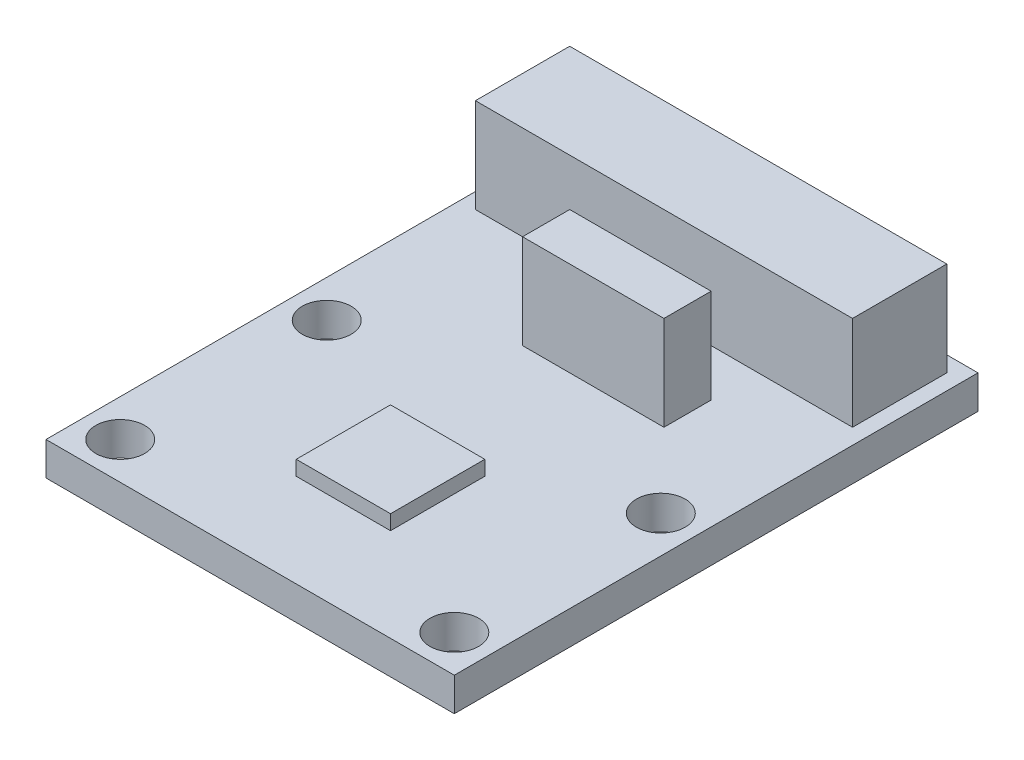
ISO-10303-21;
HEADER;
FILE_DESCRIPTION(('STEP AP214'),'2;1');
FILE_NAME('part.step','',(''),(''),'','','');
FILE_SCHEMA(('AUTOMOTIVE_DESIGN { 1 0 10303 214 1 1 1 1 }'));
ENDSEC;
DATA;
#1=APPLICATION_CONTEXT('core data for automotive mechanical design processes');
#2=APPLICATION_PROTOCOL_DEFINITION('international standard','automotive_design',2000,#1);
#3=PRODUCT_CONTEXT('',#1,'mechanical');
#4=PRODUCT('Part','Part','',(#3));
#5=PRODUCT_RELATED_PRODUCT_CATEGORY('part','',(#4));
#6=PRODUCT_DEFINITION_FORMATION('','',#4);
#7=PRODUCT_DEFINITION_CONTEXT('part definition',#1,'design');
#8=PRODUCT_DEFINITION('design','',#6,#7);
#9=PRODUCT_DEFINITION_SHAPE('','',#8);
#10=(LENGTH_UNIT() NAMED_UNIT(*) SI_UNIT(.MILLI.,.METRE.));
#11=(NAMED_UNIT(*) PLANE_ANGLE_UNIT() SI_UNIT($,.RADIAN.));
#12=(NAMED_UNIT(*) SI_UNIT($,.STERADIAN.) SOLID_ANGLE_UNIT());
#13=UNCERTAINTY_MEASURE_WITH_UNIT(LENGTH_MEASURE(1.E-05),#10,'distance_accuracy_value','');
#14=(GEOMETRIC_REPRESENTATION_CONTEXT(3) GLOBAL_UNCERTAINTY_ASSIGNED_CONTEXT((#13)) GLOBAL_UNIT_ASSIGNED_CONTEXT((#10,
#11,#12)) REPRESENTATION_CONTEXT('',''));
#15=CARTESIAN_POINT('',(0.,0.,0.));
#16=DIRECTION('',(0.,0.,1.));
#17=DIRECTION('',(1.,0.,0.));
#18=AXIS2_PLACEMENT_3D('',#15,#16,#17);
#19=CARTESIAN_POINT('',(0.,1.8,0.));
#20=DIRECTION('',(0.,-1.,0.));
#21=DIRECTION('',(0.,0.,-1.));
#22=AXIS2_PLACEMENT_3D('',#19,#20,#21);
#23=PLANE('',#22);
#24=DIRECTION('',(0.,0.,-1.));
#25=VECTOR('',#24,1.);
#26=CARTESIAN_POINT('',(-10.16,1.8,0.));
#27=LINE('',#26,#25);
#28=CARTESIAN_POINT('',(-10.16,1.8,-14.734192513565));
#29=VERTEX_POINT('',#28);
#30=CARTESIAN_POINT('',(-10.16,1.8,-19.814192513565));
#31=VERTEX_POINT('',#30);
#32=EDGE_CURVE('E173',#29,#31,#27,.T.);
#33=ORIENTED_EDGE('',*,*,#32,.T.);
#34=DIRECTION('',(1.,0.,0.));
#35=VECTOR('',#34,1.);
#36=CARTESIAN_POINT('',(0.,1.8,-19.814192513565));
#37=LINE('',#36,#35);
#38=CARTESIAN_POINT('',(10.16,1.8,-19.814192513565));
#39=VERTEX_POINT('',#38);
#40=EDGE_CURVE('E180',#31,#39,#37,.T.);
#41=ORIENTED_EDGE('',*,*,#40,.T.);
#42=DIRECTION('',(0.,0.,1.));
#43=VECTOR('',#42,1.);
#44=CARTESIAN_POINT('',(10.16,1.8,0.));
#45=LINE('',#44,#43);
#46=CARTESIAN_POINT('',(10.16,1.8,-14.734192513565));
#47=VERTEX_POINT('',#46);
#48=EDGE_CURVE('E153',#39,#47,#45,.T.);
#49=ORIENTED_EDGE('',*,*,#48,.T.);
#50=DIRECTION('',(-1.,0.,0.));
#51=VECTOR('',#50,1.);
#52=CARTESIAN_POINT('',(0.,1.8,-14.734192513565));
#53=LINE('',#52,#51);
#54=EDGE_CURVE('E50',#47,#29,#53,.T.);
#55=ORIENTED_EDGE('',*,*,#54,.T.);
#56=EDGE_LOOP('',(#33,#41,#49,#55));
#57=FACE_BOUND('',#56,.T.);
#58=DIRECTION('',(0.,0.,-1.));
#59=VECTOR('',#58,1.);
#60=CARTESIAN_POINT('',(-2.54,1.8,0.));
#61=LINE('',#60,#59);
#62=CARTESIAN_POINT('',(-2.54,1.8,-9.65419251356504));
#63=VERTEX_POINT('',#62);
#64=CARTESIAN_POINT('',(-2.54,1.8,-12.194192513565));
#65=VERTEX_POINT('',#64);
#66=EDGE_CURVE('E193',#63,#65,#61,.T.);
#67=ORIENTED_EDGE('',*,*,#66,.T.);
#68=DIRECTION('',(1.,0.,0.));
#69=VECTOR('',#68,1.);
#70=CARTESIAN_POINT('',(0.,1.8,-12.194192513565));
#71=LINE('',#70,#69);
#72=CARTESIAN_POINT('',(5.08,1.8,-12.194192513565));
#73=VERTEX_POINT('',#72);
#74=EDGE_CURVE('E185',#65,#73,#71,.T.);
#75=ORIENTED_EDGE('',*,*,#74,.T.);
#76=DIRECTION('',(0.,0.,1.));
#77=VECTOR('',#76,1.);
#78=CARTESIAN_POINT('',(5.08,1.8,0.));
#79=LINE('',#78,#77);
#80=CARTESIAN_POINT('',(5.08,1.8,-9.65419251356504));
#81=VERTEX_POINT('',#80);
#82=EDGE_CURVE('E205',#73,#81,#79,.T.);
#83=ORIENTED_EDGE('',*,*,#82,.T.);
#84=DIRECTION('',(-1.,0.,0.));
#85=VECTOR('',#84,1.);
#86=CARTESIAN_POINT('',(0.,1.8,-9.65419251356504));
#87=LINE('',#86,#85);
#88=EDGE_CURVE('E58',#81,#63,#87,.T.);
#89=ORIENTED_EDGE('',*,*,#88,.T.);
#90=EDGE_LOOP('',(#67,#75,#83,#89));
#91=FACE_BOUND('',#90,.T.);
#92=CARTESIAN_POINT('',(-9.,1.8,5.5625));
#93=DIRECTION('',(0.,1.,0.));
#94=DIRECTION('',(0.,0.,1.));
#95=AXIS2_PLACEMENT_3D('',#92,#93,#94);
#96=CIRCLE('',#95,1.315);
#97=CARTESIAN_POINT('',(-9.,1.8,6.8775));
#98=VERTEX_POINT('',#97);
#99=EDGE_CURVE('E252',#98,#98,#96,.T.);
#100=ORIENTED_EDGE('',*,*,#99,.F.);
#101=EDGE_LOOP('',(#100));
#102=FACE_BOUND('',#101,.T.);
#103=CARTESIAN_POINT('',(9.,1.8,5.5625));
#104=DIRECTION('',(0.,1.,0.));
#105=DIRECTION('',(0.,0.,1.));
#106=AXIS2_PLACEMENT_3D('',#103,#104,#105);
#107=CIRCLE('',#106,1.315);
#108=CARTESIAN_POINT('',(9.,1.8,6.8775));
#109=VERTEX_POINT('',#108);
#110=EDGE_CURVE('E258',#109,#109,#107,.T.);
#111=ORIENTED_EDGE('',*,*,#110,.F.);
#112=EDGE_LOOP('',(#111));
#113=FACE_BOUND('',#112,.T.);
#114=CARTESIAN_POINT('',(9.,1.8,-5.5625));
#115=DIRECTION('',(0.,1.,0.));
#116=DIRECTION('',(0.,0.,1.));
#117=AXIS2_PLACEMENT_3D('',#114,#115,#116);
#118=CIRCLE('',#117,1.315);
#119=CARTESIAN_POINT('',(9.,1.8,-4.2475));
#120=VERTEX_POINT('',#119);
#121=EDGE_CURVE('E264',#120,#120,#118,.T.);
#122=ORIENTED_EDGE('',*,*,#121,.F.);
#123=EDGE_LOOP('',(#122));
#124=FACE_BOUND('',#123,.T.);
#125=CARTESIAN_POINT('',(-9.,1.8,-5.5625));
#126=DIRECTION('',(0.,1.,0.));
#127=DIRECTION('',(0.,0.,1.));
#128=AXIS2_PLACEMENT_3D('',#125,#126,#127);
#129=CIRCLE('',#128,1.315);
#130=CARTESIAN_POINT('',(-9.,1.8,-4.2475));
#131=VERTEX_POINT('',#130);
#132=EDGE_CURVE('E270',#131,#131,#129,.T.);
#133=ORIENTED_EDGE('',*,*,#132,.F.);
#134=EDGE_LOOP('',(#133));
#135=FACE_BOUND('',#134,.T.);
#136=DIRECTION('',(0.,0.,-1.));
#137=VECTOR('',#136,1.);
#138=CARTESIAN_POINT('',(11.,1.8,7.5625));
#139=LINE('',#138,#137);
#140=CARTESIAN_POINT('',(11.,1.8,7.5625));
#141=VERTEX_POINT('',#140);
#142=CARTESIAN_POINT('',(11.,1.8,-20.654192513565));
#143=VERTEX_POINT('',#142);
#144=EDGE_CURVE('E276',#141,#143,#139,.T.);
#145=ORIENTED_EDGE('',*,*,#144,.T.);
#146=DIRECTION('',(-1.,0.,0.));
#147=VECTOR('',#146,1.);
#148=CARTESIAN_POINT('',(-11.,1.8,-20.654192513565));
#149=LINE('',#148,#147);
#150=CARTESIAN_POINT('',(-11.,1.8,-20.654192513565));
#151=VERTEX_POINT('',#150);
#152=EDGE_CURVE('E279',#143,#151,#149,.T.);
#153=ORIENTED_EDGE('',*,*,#152,.T.);
#154=DIRECTION('',(0.,0.,1.));
#155=VECTOR('',#154,1.);
#156=CARTESIAN_POINT('',(-11.,1.8,7.5625));
#157=LINE('',#156,#155);
#158=CARTESIAN_POINT('',(-11.,1.8,7.5625));
#159=VERTEX_POINT('',#158);
#160=EDGE_CURVE('E282',#151,#159,#157,.T.);
#161=ORIENTED_EDGE('',*,*,#160,.T.);
#162=DIRECTION('',(1.,0.,0.));
#163=VECTOR('',#162,1.);
#164=CARTESIAN_POINT('',(-11.,1.8,7.5625));
#165=LINE('',#164,#163);
#166=EDGE_CURVE('E284',#159,#141,#165,.T.);
#167=ORIENTED_EDGE('',*,*,#166,.T.);
#168=EDGE_LOOP('',(#145,#153,#161,#167));
#169=FACE_BOUND('',#168,.T.);
#170=DIRECTION('',(0.,0.,-1.));
#171=VECTOR('',#170,1.);
#172=CARTESIAN_POINT('',(2.54,1.8,2.54));
#173=LINE('',#172,#171);
#174=CARTESIAN_POINT('',(2.54,1.8,2.54));
#175=VERTEX_POINT('',#174);
#176=CARTESIAN_POINT('',(2.54,1.8,-2.54));
#177=VERTEX_POINT('',#176);
#178=EDGE_CURVE('E213',#175,#177,#173,.T.);
#179=ORIENTED_EDGE('',*,*,#178,.F.);
#180=DIRECTION('',(1.,0.,0.));
#181=VECTOR('',#180,1.);
#182=CARTESIAN_POINT('',(-2.54,1.8,2.54));
#183=LINE('',#182,#181);
#184=CARTESIAN_POINT('',(-2.54,1.8,2.54));
#185=VERTEX_POINT('',#184);
#186=EDGE_CURVE('E223',#185,#175,#183,.T.);
#187=ORIENTED_EDGE('',*,*,#186,.F.);
#188=DIRECTION('',(0.,0.,1.));
#189=VECTOR('',#188,1.);
#190=CARTESIAN_POINT('',(-2.54,1.8,2.54));
#191=LINE('',#190,#189);
#192=CARTESIAN_POINT('',(-2.54,1.8,-2.54));
#193=VERTEX_POINT('',#192);
#194=EDGE_CURVE('E235',#193,#185,#191,.T.);
#195=ORIENTED_EDGE('',*,*,#194,.F.);
#196=DIRECTION('',(-1.,0.,0.));
#197=VECTOR('',#196,1.);
#198=CARTESIAN_POINT('',(-2.54,1.8,-2.54));
#199=LINE('',#198,#197);
#200=EDGE_CURVE('E232',#177,#193,#199,.T.);
#201=ORIENTED_EDGE('',*,*,#200,.F.);
#202=EDGE_LOOP('',(#179,#187,#195,#201));
#203=FACE_BOUND('',#202,.T.);
#204=ADVANCED_FACE('F35',(#57,#91,#102,#113,#124,#135,#169,#203),#23,.F.);
#205=CARTESIAN_POINT('',(0.,0.,0.));
#206=DIRECTION('',(0.,-1.,0.));
#207=DIRECTION('',(0.,0.,-1.));
#208=AXIS2_PLACEMENT_3D('',#205,#206,#207);
#209=PLANE('',#208);
#210=CARTESIAN_POINT('',(9.,0.,5.5625));
#211=DIRECTION('',(0.,1.,0.));
#212=DIRECTION('',(0.,0.,1.));
#213=AXIS2_PLACEMENT_3D('',#210,#211,#212);
#214=CIRCLE('',#213,1.315);
#215=CARTESIAN_POINT('',(9.,0.,6.8775));
#216=VERTEX_POINT('',#215);
#217=EDGE_CURVE('E255',#216,#216,#214,.T.);
#218=ORIENTED_EDGE('',*,*,#217,.T.);
#219=EDGE_LOOP('',(#218));
#220=FACE_BOUND('',#219,.T.);
#221=CARTESIAN_POINT('',(-9.,0.,-5.5625));
#222=DIRECTION('',(0.,1.,0.));
#223=DIRECTION('',(0.,0.,1.));
#224=AXIS2_PLACEMENT_3D('',#221,#222,#223);
#225=CIRCLE('',#224,1.315);
#226=CARTESIAN_POINT('',(-9.,0.,-4.2475));
#227=VERTEX_POINT('',#226);
#228=EDGE_CURVE('E267',#227,#227,#225,.T.);
#229=ORIENTED_EDGE('',*,*,#228,.T.);
#230=EDGE_LOOP('',(#229));
#231=FACE_BOUND('',#230,.T.);
#232=DIRECTION('',(0.,0.,-1.));
#233=VECTOR('',#232,1.);
#234=CARTESIAN_POINT('',(11.,0.,7.5625));
#235=LINE('',#234,#233);
#236=CARTESIAN_POINT('',(11.,0.,7.5625));
#237=VERTEX_POINT('',#236);
#238=CARTESIAN_POINT('',(11.,0.,-20.654192513565));
#239=VERTEX_POINT('',#238);
#240=EDGE_CURVE('E273',#237,#239,#235,.T.);
#241=ORIENTED_EDGE('',*,*,#240,.F.);
#242=DIRECTION('',(1.,0.,0.));
#243=VECTOR('',#242,1.);
#244=CARTESIAN_POINT('',(-11.,0.,7.5625));
#245=LINE('',#244,#243);
#246=CARTESIAN_POINT('',(-11.,0.,7.5625));
#247=VERTEX_POINT('',#246);
#248=EDGE_CURVE('E280',#247,#237,#245,.T.);
#249=ORIENTED_EDGE('',*,*,#248,.F.);
#250=DIRECTION('',(0.,0.,1.));
#251=VECTOR('',#250,1.);
#252=CARTESIAN_POINT('',(-11.,0.,7.5625));
#253=LINE('',#252,#251);
#254=CARTESIAN_POINT('',(-11.,0.,-20.654192513565));
#255=VERTEX_POINT('',#254);
#256=EDGE_CURVE('E291',#255,#247,#253,.T.);
#257=ORIENTED_EDGE('',*,*,#256,.F.);
#258=DIRECTION('',(-1.,0.,0.));
#259=VECTOR('',#258,1.);
#260=CARTESIAN_POINT('',(-11.,0.,-20.654192513565));
#261=LINE('',#260,#259);
#262=EDGE_CURVE('E289',#239,#255,#261,.T.);
#263=ORIENTED_EDGE('',*,*,#262,.F.);
#264=EDGE_LOOP('',(#241,#249,#257,#263));
#265=FACE_BOUND('',#264,.T.);
#266=CARTESIAN_POINT('',(9.,0.,-5.5625));
#267=DIRECTION('',(0.,1.,0.));
#268=DIRECTION('',(0.,0.,1.));
#269=AXIS2_PLACEMENT_3D('',#266,#267,#268);
#270=CIRCLE('',#269,1.315);
#271=CARTESIAN_POINT('',(9.,0.,-4.2475));
#272=VERTEX_POINT('',#271);
#273=EDGE_CURVE('E261',#272,#272,#270,.T.);
#274=ORIENTED_EDGE('',*,*,#273,.T.);
#275=EDGE_LOOP('',(#274));
#276=FACE_BOUND('',#275,.T.);
#277=CARTESIAN_POINT('',(-9.,0.,5.5625));
#278=DIRECTION('',(0.,1.,0.));
#279=DIRECTION('',(0.,0.,1.));
#280=AXIS2_PLACEMENT_3D('',#277,#278,#279);
#281=CIRCLE('',#280,1.315);
#282=CARTESIAN_POINT('',(-9.,0.,6.8775));
#283=VERTEX_POINT('',#282);
#284=EDGE_CURVE('E251',#283,#283,#281,.T.);
#285=ORIENTED_EDGE('',*,*,#284,.T.);
#286=EDGE_LOOP('',(#285));
#287=FACE_BOUND('',#286,.T.);
#288=ADVANCED_FACE('F309',(#220,#231,#265,#276,#287),#209,.T.);
#289=CARTESIAN_POINT('',(11.,1.8,7.5625));
#290=DIRECTION('',(-1.,0.,0.));
#291=DIRECTION('',(0.,0.,1.));
#292=AXIS2_PLACEMENT_3D('',#289,#290,#291);
#293=PLANE('',#292);
#294=ORIENTED_EDGE('',*,*,#240,.T.);
#295=DIRECTION('',(0.,-1.,0.));
#296=VECTOR('',#295,1.);
#297=CARTESIAN_POINT('',(11.,1.8,-20.654192513565));
#298=LINE('',#297,#296);
#299=EDGE_CURVE('E11',#143,#239,#298,.T.);
#300=ORIENTED_EDGE('',*,*,#299,.F.);
#301=ORIENTED_EDGE('',*,*,#144,.F.);
#302=DIRECTION('',(0.,-1.,0.));
#303=VECTOR('',#302,1.);
#304=CARTESIAN_POINT('',(11.,1.8,7.5625));
#305=LINE('',#304,#303);
#306=EDGE_CURVE('E286',#141,#237,#305,.T.);
#307=ORIENTED_EDGE('',*,*,#306,.T.);
#308=EDGE_LOOP('',(#294,#300,#301,#307));
#309=FACE_BOUND('',#308,.T.);
#310=ADVANCED_FACE('F37',(#309),#293,.F.);
#311=CARTESIAN_POINT('',(-11.,1.8,-20.654192513565));
#312=DIRECTION('',(0.,0.,1.));
#313=DIRECTION('',(1.,0.,0.));
#314=AXIS2_PLACEMENT_3D('',#311,#312,#313);
#315=PLANE('',#314);
#316=ORIENTED_EDGE('',*,*,#262,.T.);
#317=DIRECTION('',(0.,-1.,0.));
#318=VECTOR('',#317,1.);
#319=CARTESIAN_POINT('',(-11.,1.8,-20.654192513565));
#320=LINE('',#319,#318);
#321=EDGE_CURVE('E43',#151,#255,#320,.T.);
#322=ORIENTED_EDGE('',*,*,#321,.F.);
#323=ORIENTED_EDGE('',*,*,#152,.F.);
#324=ORIENTED_EDGE('',*,*,#299,.T.);
#325=EDGE_LOOP('',(#316,#322,#323,#324));
#326=FACE_BOUND('',#325,.T.);
#327=ADVANCED_FACE('F320',(#326),#315,.F.);
#328=CARTESIAN_POINT('',(-11.,1.8,7.5625));
#329=DIRECTION('',(1.,0.,0.));
#330=DIRECTION('',(0.,0.,-1.));
#331=AXIS2_PLACEMENT_3D('',#328,#329,#330);
#332=PLANE('',#331);
#333=ORIENTED_EDGE('',*,*,#256,.T.);
#334=DIRECTION('',(0.,-1.,0.));
#335=VECTOR('',#334,1.);
#336=CARTESIAN_POINT('',(-11.,1.8,7.5625));
#337=LINE('',#336,#335);
#338=EDGE_CURVE('E296',#159,#247,#337,.T.);
#339=ORIENTED_EDGE('',*,*,#338,.F.);
#340=ORIENTED_EDGE('',*,*,#160,.F.);
#341=ORIENTED_EDGE('',*,*,#321,.T.);
#342=EDGE_LOOP('',(#333,#339,#340,#341));
#343=FACE_BOUND('',#342,.T.);
#344=ADVANCED_FACE('F303',(#343),#332,.F.);
#345=CARTESIAN_POINT('',(-11.,1.8,7.5625));
#346=DIRECTION('',(0.,0.,-1.));
#347=DIRECTION('',(-1.,0.,0.));
#348=AXIS2_PLACEMENT_3D('',#345,#346,#347);
#349=PLANE('',#348);
#350=ORIENTED_EDGE('',*,*,#248,.T.);
#351=ORIENTED_EDGE('',*,*,#306,.F.);
#352=ORIENTED_EDGE('',*,*,#166,.F.);
#353=ORIENTED_EDGE('',*,*,#338,.T.);
#354=EDGE_LOOP('',(#350,#351,#352,#353));
#355=FACE_BOUND('',#354,.T.);
#356=ADVANCED_FACE('F313',(#355),#349,.F.);
#357=CARTESIAN_POINT('',(-9.,1.8,-5.5625));
#358=DIRECTION('',(0.,-1.,0.));
#359=DIRECTION('',(0.,0.,-1.));
#360=AXIS2_PLACEMENT_3D('',#357,#358,#359);
#361=CYLINDRICAL_SURFACE('',#360,1.315);
#362=ORIENTED_EDGE('',*,*,#132,.T.);
#363=EDGE_LOOP('',(#362));
#364=FACE_BOUND('',#363,.T.);
#365=ORIENTED_EDGE('',*,*,#228,.F.);
#366=EDGE_LOOP('',(#365));
#367=FACE_BOUND('',#366,.T.);
#368=ADVANCED_FACE('F337',(#364,#367),#361,.F.);
#369=CARTESIAN_POINT('',(9.,1.8,-5.5625));
#370=DIRECTION('',(0.,-1.,0.));
#371=DIRECTION('',(0.,0.,-1.));
#372=AXIS2_PLACEMENT_3D('',#369,#370,#371);
#373=CYLINDRICAL_SURFACE('',#372,1.315);
#374=ORIENTED_EDGE('',*,*,#121,.T.);
#375=EDGE_LOOP('',(#374));
#376=FACE_BOUND('',#375,.T.);
#377=ORIENTED_EDGE('',*,*,#273,.F.);
#378=EDGE_LOOP('',(#377));
#379=FACE_BOUND('',#378,.T.);
#380=ADVANCED_FACE('F344',(#376,#379),#373,.F.);
#381=CARTESIAN_POINT('',(9.,1.8,5.5625));
#382=DIRECTION('',(0.,-1.,0.));
#383=DIRECTION('',(0.,0.,-1.));
#384=AXIS2_PLACEMENT_3D('',#381,#382,#383);
#385=CYLINDRICAL_SURFACE('',#384,1.315);
#386=ORIENTED_EDGE('',*,*,#110,.T.);
#387=EDGE_LOOP('',(#386));
#388=FACE_BOUND('',#387,.T.);
#389=ORIENTED_EDGE('',*,*,#217,.F.);
#390=EDGE_LOOP('',(#389));
#391=FACE_BOUND('',#390,.T.);
#392=ADVANCED_FACE('F349',(#388,#391),#385,.F.);
#393=CARTESIAN_POINT('',(-9.,1.8,5.5625));
#394=DIRECTION('',(0.,-1.,0.));
#395=DIRECTION('',(0.,0.,-1.));
#396=AXIS2_PLACEMENT_3D('',#393,#394,#395);
#397=CYLINDRICAL_SURFACE('',#396,1.315);
#398=ORIENTED_EDGE('',*,*,#99,.T.);
#399=EDGE_LOOP('',(#398));
#400=FACE_BOUND('',#399,.T.);
#401=ORIENTED_EDGE('',*,*,#284,.F.);
#402=EDGE_LOOP('',(#401));
#403=FACE_BOUND('',#402,.T.);
#404=ADVANCED_FACE('F359',(#400,#403),#397,.F.);
#405=CARTESIAN_POINT('',(2.54,2.59375,2.54));
#406=DIRECTION('',(-1.,0.,0.));
#407=DIRECTION('',(0.,0.,1.));
#408=AXIS2_PLACEMENT_3D('',#405,#406,#407);
#409=PLANE('',#408);
#410=ORIENTED_EDGE('',*,*,#178,.T.);
#411=DIRECTION('',(0.,-1.,0.));
#412=VECTOR('',#411,1.);
#413=CARTESIAN_POINT('',(2.54,2.59375,-2.54));
#414=LINE('',#413,#412);
#415=CARTESIAN_POINT('',(2.54,2.59375,-2.54));
#416=VERTEX_POINT('',#415);
#417=EDGE_CURVE('E248',#416,#177,#414,.T.);
#418=ORIENTED_EDGE('',*,*,#417,.F.);
#419=DIRECTION('',(0.,0.,-1.));
#420=VECTOR('',#419,1.);
#421=CARTESIAN_POINT('',(2.54,2.59375,2.54));
#422=LINE('',#421,#420);
#423=CARTESIAN_POINT('',(2.54,2.59375,2.54));
#424=VERTEX_POINT('',#423);
#425=EDGE_CURVE('E219',#424,#416,#422,.T.);
#426=ORIENTED_EDGE('',*,*,#425,.F.);
#427=DIRECTION('',(0.,-1.,0.));
#428=VECTOR('',#427,1.);
#429=CARTESIAN_POINT('',(2.54,2.59375,2.54));
#430=LINE('',#429,#428);
#431=EDGE_CURVE('E229',#424,#175,#430,.T.);
#432=ORIENTED_EDGE('',*,*,#431,.T.);
#433=EDGE_LOOP('',(#410,#418,#426,#432));
#434=FACE_BOUND('',#433,.T.);
#435=ADVANCED_FACE('F366',(#434),#409,.F.);
#436=CARTESIAN_POINT('',(-2.54,2.59375,-2.54));
#437=DIRECTION('',(0.,0.,1.));
#438=DIRECTION('',(1.,0.,0.));
#439=AXIS2_PLACEMENT_3D('',#436,#437,#438);
#440=PLANE('',#439);
#441=ORIENTED_EDGE('',*,*,#200,.T.);
#442=DIRECTION('',(0.,-1.,0.));
#443=VECTOR('',#442,1.);
#444=CARTESIAN_POINT('',(-2.54,2.59375,-2.54));
#445=LINE('',#444,#443);
#446=CARTESIAN_POINT('',(-2.54,2.59375,-2.54));
#447=VERTEX_POINT('',#446);
#448=EDGE_CURVE('E245',#447,#193,#445,.T.);
#449=ORIENTED_EDGE('',*,*,#448,.F.);
#450=DIRECTION('',(-1.,0.,0.));
#451=VECTOR('',#450,1.);
#452=CARTESIAN_POINT('',(-2.54,2.59375,-2.54));
#453=LINE('',#452,#451);
#454=EDGE_CURVE('E222',#416,#447,#453,.T.);
#455=ORIENTED_EDGE('',*,*,#454,.F.);
#456=ORIENTED_EDGE('',*,*,#417,.T.);
#457=EDGE_LOOP('',(#441,#449,#455,#456));
#458=FACE_BOUND('',#457,.T.);
#459=ADVANCED_FACE('F370',(#458),#440,.F.);
#460=CARTESIAN_POINT('',(-2.54,2.59375,2.54));
#461=DIRECTION('',(1.,0.,0.));
#462=DIRECTION('',(0.,0.,-1.));
#463=AXIS2_PLACEMENT_3D('',#460,#461,#462);
#464=PLANE('',#463);
#465=ORIENTED_EDGE('',*,*,#194,.T.);
#466=DIRECTION('',(0.,-1.,0.));
#467=VECTOR('',#466,1.);
#468=CARTESIAN_POINT('',(-2.54,2.59375,2.54));
#469=LINE('',#468,#467);
#470=CARTESIAN_POINT('',(-2.54,2.59375,2.54));
#471=VERTEX_POINT('',#470);
#472=EDGE_CURVE('E242',#471,#185,#469,.T.);
#473=ORIENTED_EDGE('',*,*,#472,.F.);
#474=DIRECTION('',(0.,0.,1.));
#475=VECTOR('',#474,1.);
#476=CARTESIAN_POINT('',(-2.54,2.59375,2.54));
#477=LINE('',#476,#475);
#478=EDGE_CURVE('E225',#447,#471,#477,.T.);
#479=ORIENTED_EDGE('',*,*,#478,.F.);
#480=ORIENTED_EDGE('',*,*,#448,.T.);
#481=EDGE_LOOP('',(#465,#473,#479,#480));
#482=FACE_BOUND('',#481,.T.);
#483=ADVANCED_FACE('F374',(#482),#464,.F.);
#484=CARTESIAN_POINT('',(-2.54,2.59375,2.54));
#485=DIRECTION('',(0.,0.,-1.));
#486=DIRECTION('',(-1.,0.,0.));
#487=AXIS2_PLACEMENT_3D('',#484,#485,#486);
#488=PLANE('',#487);
#489=ORIENTED_EDGE('',*,*,#186,.T.);
#490=ORIENTED_EDGE('',*,*,#431,.F.);
#491=DIRECTION('',(1.,0.,0.));
#492=VECTOR('',#491,1.);
#493=CARTESIAN_POINT('',(-2.54,2.59375,2.54));
#494=LINE('',#493,#492);
#495=EDGE_CURVE('E227',#471,#424,#494,.T.);
#496=ORIENTED_EDGE('',*,*,#495,.F.);
#497=ORIENTED_EDGE('',*,*,#472,.T.);
#498=EDGE_LOOP('',(#489,#490,#496,#497));
#499=FACE_BOUND('',#498,.T.);
#500=ADVANCED_FACE('F378',(#499),#488,.F.);
#501=CARTESIAN_POINT('',(0.,2.59375,0.));
#502=DIRECTION('',(0.,-1.,0.));
#503=DIRECTION('',(0.,0.,-1.));
#504=AXIS2_PLACEMENT_3D('',#501,#502,#503);
#505=PLANE('',#504);
#506=ORIENTED_EDGE('',*,*,#425,.T.);
#507=ORIENTED_EDGE('',*,*,#454,.T.);
#508=ORIENTED_EDGE('',*,*,#478,.T.);
#509=ORIENTED_EDGE('',*,*,#495,.T.);
#510=EDGE_LOOP('',(#506,#507,#508,#509));
#511=FACE_BOUND('',#510,.T.);
#512=ADVANCED_FACE('F382',(#511),#505,.F.);
#513=CARTESIAN_POINT('',(0.,6.88,-12.194192513565));
#514=DIRECTION('',(0.,0.,-1.));
#515=DIRECTION('',(-1.,0.,0.));
#516=AXIS2_PLACEMENT_3D('',#513,#514,#515);
#517=PLANE('',#516);
#518=ORIENTED_EDGE('',*,*,#74,.F.);
#519=DIRECTION('',(0.,-1.,0.));
#520=VECTOR('',#519,1.);
#521=CARTESIAN_POINT('',(-2.54,6.88,-12.194192513565));
#522=LINE('',#521,#520);
#523=CARTESIAN_POINT('',(-2.54,6.88,-12.194192513565));
#524=VERTEX_POINT('',#523);
#525=EDGE_CURVE('E211',#524,#65,#522,.T.);
#526=ORIENTED_EDGE('',*,*,#525,.F.);
#527=DIRECTION('',(1.,0.,0.));
#528=VECTOR('',#527,1.);
#529=CARTESIAN_POINT('',(0.,6.88,-12.194192513565));
#530=LINE('',#529,#528);
#531=CARTESIAN_POINT('',(5.08,6.88,-12.194192513565));
#532=VERTEX_POINT('',#531);
#533=EDGE_CURVE('E189',#524,#532,#530,.T.);
#534=ORIENTED_EDGE('',*,*,#533,.T.);
#535=DIRECTION('',(0.,-1.,0.));
#536=VECTOR('',#535,1.);
#537=CARTESIAN_POINT('',(5.08,6.88,-12.194192513565));
#538=LINE('',#537,#536);
#539=EDGE_CURVE('E202',#532,#73,#538,.T.);
#540=ORIENTED_EDGE('',*,*,#539,.T.);
#541=EDGE_LOOP('',(#518,#526,#534,#540));
#542=FACE_BOUND('',#541,.T.);
#543=ADVANCED_FACE('F386',(#542),#517,.T.);
#544=CARTESIAN_POINT('',(-2.54,6.88,0.));
#545=DIRECTION('',(-1.,0.,0.));
#546=DIRECTION('',(0.,0.,1.));
#547=AXIS2_PLACEMENT_3D('',#544,#545,#546);
#548=PLANE('',#547);
#549=ORIENTED_EDGE('',*,*,#66,.F.);
#550=DIRECTION('',(0.,-1.,0.));
#551=VECTOR('',#550,1.);
#552=CARTESIAN_POINT('',(-2.54,6.88,-9.65419251356504));
#553=LINE('',#552,#551);
#554=CARTESIAN_POINT('',(-2.54,6.88,-9.65419251356504));
#555=VERTEX_POINT('',#554);
#556=EDGE_CURVE('E214',#555,#63,#553,.T.);
#557=ORIENTED_EDGE('',*,*,#556,.F.);
#558=DIRECTION('',(0.,0.,-1.));
#559=VECTOR('',#558,1.);
#560=CARTESIAN_POINT('',(-2.54,6.88,0.));
#561=LINE('',#560,#559);
#562=EDGE_CURVE('E199',#555,#524,#561,.T.);
#563=ORIENTED_EDGE('',*,*,#562,.T.);
#564=ORIENTED_EDGE('',*,*,#525,.T.);
#565=EDGE_LOOP('',(#549,#557,#563,#564));
#566=FACE_BOUND('',#565,.T.);
#567=ADVANCED_FACE('F390',(#566),#548,.T.);
#568=CARTESIAN_POINT('',(0.,6.88,-9.65419251356504));
#569=DIRECTION('',(0.,0.,1.));
#570=DIRECTION('',(1.,0.,0.));
#571=AXIS2_PLACEMENT_3D('',#568,#569,#570);
#572=PLANE('',#571);
#573=ORIENTED_EDGE('',*,*,#88,.F.);
#574=DIRECTION('',(0.,-1.,0.));
#575=VECTOR('',#574,1.);
#576=CARTESIAN_POINT('',(5.08,6.88,-9.65419251356504));
#577=LINE('',#576,#575);
#578=CARTESIAN_POINT('',(5.08,6.88,-9.65419251356504));
#579=VERTEX_POINT('',#578);
#580=EDGE_CURVE('E216',#579,#81,#577,.T.);
#581=ORIENTED_EDGE('',*,*,#580,.F.);
#582=DIRECTION('',(-1.,0.,0.));
#583=VECTOR('',#582,1.);
#584=CARTESIAN_POINT('',(0.,6.88,-9.65419251356504));
#585=LINE('',#584,#583);
#586=EDGE_CURVE('E196',#579,#555,#585,.T.);
#587=ORIENTED_EDGE('',*,*,#586,.T.);
#588=ORIENTED_EDGE('',*,*,#556,.T.);
#589=EDGE_LOOP('',(#573,#581,#587,#588));
#590=FACE_BOUND('',#589,.T.);
#591=ADVANCED_FACE('F396',(#590),#572,.T.);
#592=CARTESIAN_POINT('',(5.08,6.88,0.));
#593=DIRECTION('',(1.,0.,0.));
#594=DIRECTION('',(0.,0.,-1.));
#595=AXIS2_PLACEMENT_3D('',#592,#593,#594);
#596=PLANE('',#595);
#597=ORIENTED_EDGE('',*,*,#82,.F.);
#598=ORIENTED_EDGE('',*,*,#539,.F.);
#599=DIRECTION('',(0.,0.,1.));
#600=VECTOR('',#599,1.);
#601=CARTESIAN_POINT('',(5.08,6.88,0.));
#602=LINE('',#601,#600);
#603=EDGE_CURVE('E192',#532,#579,#602,.T.);
#604=ORIENTED_EDGE('',*,*,#603,.T.);
#605=ORIENTED_EDGE('',*,*,#580,.T.);
#606=EDGE_LOOP('',(#597,#598,#604,#605));
#607=FACE_BOUND('',#606,.T.);
#608=ADVANCED_FACE('F392',(#607),#596,.T.);
#609=CARTESIAN_POINT('',(0.,6.88,0.));
#610=DIRECTION('',(0.,-1.,0.));
#611=DIRECTION('',(0.,0.,-1.));
#612=AXIS2_PLACEMENT_3D('',#609,#610,#611);
#613=PLANE('',#612);
#614=ORIENTED_EDGE('',*,*,#533,.F.);
#615=ORIENTED_EDGE('',*,*,#562,.F.);
#616=ORIENTED_EDGE('',*,*,#586,.F.);
#617=ORIENTED_EDGE('',*,*,#603,.F.);
#618=EDGE_LOOP('',(#614,#615,#616,#617));
#619=FACE_BOUND('',#618,.T.);
#620=ADVANCED_FACE('F395',(#619),#613,.F.);
#621=CARTESIAN_POINT('',(0.,6.88,-19.814192513565));
#622=DIRECTION('',(0.,0.,-1.));
#623=DIRECTION('',(-1.,0.,0.));
#624=AXIS2_PLACEMENT_3D('',#621,#622,#623);
#625=PLANE('',#624);
#626=ORIENTED_EDGE('',*,*,#40,.F.);
#627=DIRECTION('',(0.,-1.,0.));
#628=VECTOR('',#627,1.);
#629=CARTESIAN_POINT('',(-10.16,6.88,-19.814192513565));
#630=LINE('',#629,#628);
#631=CARTESIAN_POINT('',(-10.16,6.88,-19.814192513565));
#632=VERTEX_POINT('',#631);
#633=EDGE_CURVE('E172',#632,#31,#630,.T.);
#634=ORIENTED_EDGE('',*,*,#633,.F.);
#635=DIRECTION('',(1.,0.,0.));
#636=VECTOR('',#635,1.);
#637=CARTESIAN_POINT('',(0.,6.88,-19.814192513565));
#638=LINE('',#637,#636);
#639=CARTESIAN_POINT('',(10.16,6.88,-19.814192513565));
#640=VERTEX_POINT('',#639);
#641=EDGE_CURVE('E166',#632,#640,#638,.T.);
#642=ORIENTED_EDGE('',*,*,#641,.T.);
#643=DIRECTION('',(0.,-1.,0.));
#644=VECTOR('',#643,1.);
#645=CARTESIAN_POINT('',(10.16,6.88,-19.814192513565));
#646=LINE('',#645,#644);
#647=EDGE_CURVE('E148',#640,#39,#646,.T.);
#648=ORIENTED_EDGE('',*,*,#647,.T.);
#649=EDGE_LOOP('',(#626,#634,#642,#648));
#650=FACE_BOUND('',#649,.T.);
#651=ADVANCED_FACE('F171',(#650),#625,.T.);
#652=CARTESIAN_POINT('',(-10.16,6.88,0.));
#653=DIRECTION('',(-1.,0.,0.));
#654=DIRECTION('',(0.,0.,1.));
#655=AXIS2_PLACEMENT_3D('',#652,#653,#654);
#656=PLANE('',#655);
#657=ORIENTED_EDGE('',*,*,#32,.F.);
#658=DIRECTION('',(0.,-1.,0.));
#659=VECTOR('',#658,1.);
#660=CARTESIAN_POINT('',(-10.16,6.88,-14.734192513565));
#661=LINE('',#660,#659);
#662=CARTESIAN_POINT('',(-10.16,6.88,-14.734192513565));
#663=VERTEX_POINT('',#662);
#664=EDGE_CURVE('E186',#663,#29,#661,.T.);
#665=ORIENTED_EDGE('',*,*,#664,.F.);
#666=DIRECTION('',(0.,0.,-1.));
#667=VECTOR('',#666,1.);
#668=CARTESIAN_POINT('',(-10.16,6.88,0.));
#669=LINE('',#668,#667);
#670=EDGE_CURVE('E159',#663,#632,#669,.T.);
#671=ORIENTED_EDGE('',*,*,#670,.T.);
#672=ORIENTED_EDGE('',*,*,#633,.T.);
#673=EDGE_LOOP('',(#657,#665,#671,#672));
#674=FACE_BOUND('',#673,.T.);
#675=ADVANCED_FACE('F408',(#674),#656,.T.);
#676=CARTESIAN_POINT('',(0.,6.88,-14.734192513565));
#677=DIRECTION('',(0.,0.,1.));
#678=DIRECTION('',(1.,0.,0.));
#679=AXIS2_PLACEMENT_3D('',#676,#677,#678);
#680=PLANE('',#679);
#681=ORIENTED_EDGE('',*,*,#54,.F.);
#682=DIRECTION('',(0.,-1.,0.));
#683=VECTOR('',#682,1.);
#684=CARTESIAN_POINT('',(10.16,6.88,-14.734192513565));
#685=LINE('',#684,#683);
#686=CARTESIAN_POINT('',(10.16,6.88,-14.734192513565));
#687=VERTEX_POINT('',#686);
#688=EDGE_CURVE('E158',#687,#47,#685,.T.);
#689=ORIENTED_EDGE('',*,*,#688,.F.);
#690=DIRECTION('',(-1.,0.,0.));
#691=VECTOR('',#690,1.);
#692=CARTESIAN_POINT('',(0.,6.88,-14.734192513565));
#693=LINE('',#692,#691);
#694=EDGE_CURVE('E169',#687,#663,#693,.T.);
#695=ORIENTED_EDGE('',*,*,#694,.T.);
#696=ORIENTED_EDGE('',*,*,#664,.T.);
#697=EDGE_LOOP('',(#681,#689,#695,#696));
#698=FACE_BOUND('',#697,.T.);
#699=ADVANCED_FACE('F411',(#698),#680,.T.);
#700=CARTESIAN_POINT('',(10.16,6.88,0.));
#701=DIRECTION('',(1.,0.,0.));
#702=DIRECTION('',(0.,0.,-1.));
#703=AXIS2_PLACEMENT_3D('',#700,#701,#702);
#704=PLANE('',#703);
#705=ORIENTED_EDGE('',*,*,#48,.F.);
#706=ORIENTED_EDGE('',*,*,#647,.F.);
#707=DIRECTION('',(0.,0.,1.));
#708=VECTOR('',#707,1.);
#709=CARTESIAN_POINT('',(10.16,6.88,0.));
#710=LINE('',#709,#708);
#711=EDGE_CURVE('E151',#640,#687,#710,.T.);
#712=ORIENTED_EDGE('',*,*,#711,.T.);
#713=ORIENTED_EDGE('',*,*,#688,.T.);
#714=EDGE_LOOP('',(#705,#706,#712,#713));
#715=FACE_BOUND('',#714,.T.);
#716=ADVANCED_FACE('F150',(#715),#704,.T.);
#717=CARTESIAN_POINT('',(0.,6.88,0.));
#718=DIRECTION('',(0.,-1.,0.));
#719=DIRECTION('',(0.,0.,-1.));
#720=AXIS2_PLACEMENT_3D('',#717,#718,#719);
#721=PLANE('',#720);
#722=ORIENTED_EDGE('',*,*,#641,.F.);
#723=ORIENTED_EDGE('',*,*,#670,.F.);
#724=ORIENTED_EDGE('',*,*,#694,.F.);
#725=ORIENTED_EDGE('',*,*,#711,.F.);
#726=EDGE_LOOP('',(#722,#723,#724,#725));
#727=FACE_BOUND('',#726,.T.);
#728=ADVANCED_FACE('F164',(#727),#721,.F.);
#729=CLOSED_SHELL('',(#204,#288,#310,#327,#344,#356,#368,#380,#392,#404,#435,#459,#483,#500,
#512,#543,#567,#591,#608,#620,#651,#675,#699,#716,#728));
#730=MANIFOLD_SOLID_BREP('B2',#729);
#731=ADVANCED_BREP_SHAPE_REPRESENTATION('',(#18,#730),#14);
#732=SHAPE_DEFINITION_REPRESENTATION(#9,#731);
ENDSEC;
END-ISO-10303-21;
